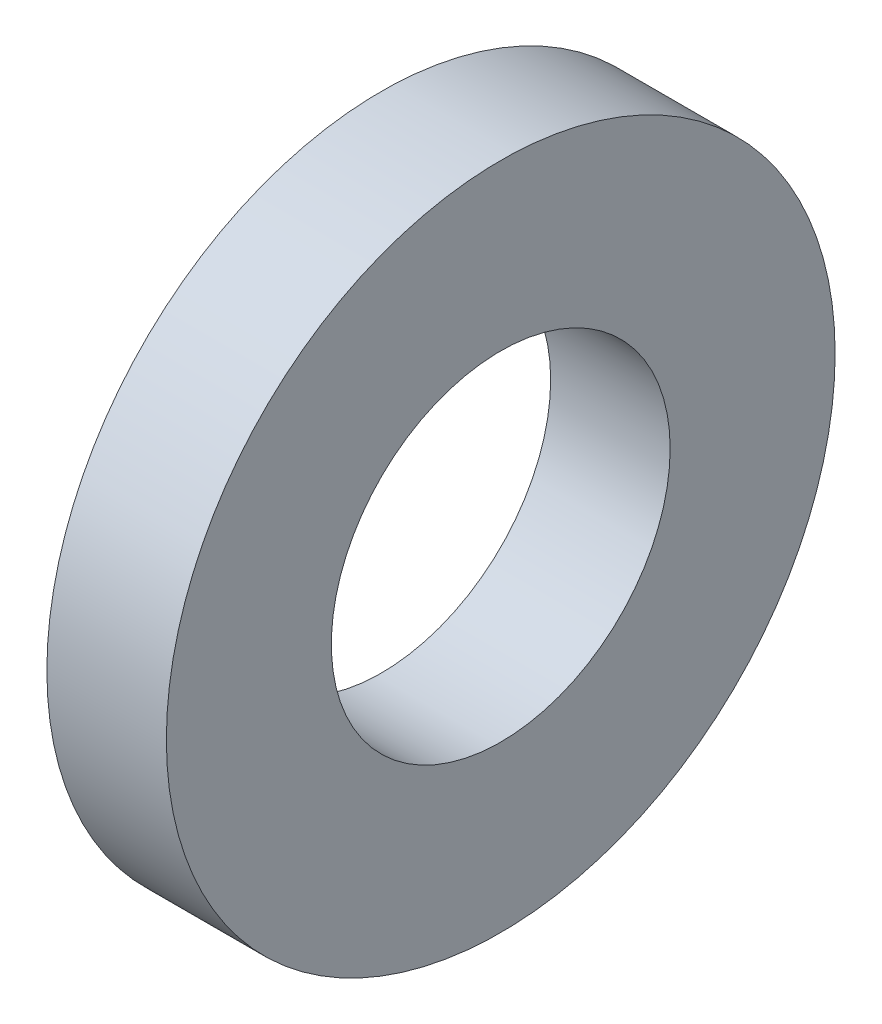
ISO-10303-21;
HEADER;
FILE_DESCRIPTION(('STEP AP214'),'2;1');
FILE_NAME('part.step','',(''),(''),'','','');
FILE_SCHEMA(('AUTOMOTIVE_DESIGN { 1 0 10303 214 1 1 1 1 }'));
ENDSEC;
DATA;
#1=APPLICATION_CONTEXT('core data for automotive mechanical design processes');
#2=APPLICATION_PROTOCOL_DEFINITION('international standard','automotive_design',2000,#1);
#3=PRODUCT_CONTEXT('',#1,'mechanical');
#4=PRODUCT('Part','Part','',(#3));
#5=PRODUCT_RELATED_PRODUCT_CATEGORY('part','',(#4));
#6=PRODUCT_DEFINITION_FORMATION('','',#4);
#7=PRODUCT_DEFINITION_CONTEXT('part definition',#1,'design');
#8=PRODUCT_DEFINITION('design','',#6,#7);
#9=PRODUCT_DEFINITION_SHAPE('','',#8);
#10=(LENGTH_UNIT() NAMED_UNIT(*) SI_UNIT(.MILLI.,.METRE.));
#11=(NAMED_UNIT(*) PLANE_ANGLE_UNIT() SI_UNIT($,.RADIAN.));
#12=(NAMED_UNIT(*) SI_UNIT($,.STERADIAN.) SOLID_ANGLE_UNIT());
#13=UNCERTAINTY_MEASURE_WITH_UNIT(LENGTH_MEASURE(1.E-05),#10,'distance_accuracy_value','');
#14=(GEOMETRIC_REPRESENTATION_CONTEXT(3) GLOBAL_UNCERTAINTY_ASSIGNED_CONTEXT((#13)) GLOBAL_UNIT_ASSIGNED_CONTEXT((#10,
#11,#12)) REPRESENTATION_CONTEXT('',''));
#15=CARTESIAN_POINT('',(0.,0.,0.));
#16=DIRECTION('',(0.,0.,1.));
#17=DIRECTION('',(1.,0.,0.));
#18=AXIS2_PLACEMENT_3D('',#15,#16,#17);
#19=CARTESIAN_POINT('',(1.7018,0.,0.));
#20=DIRECTION('',(1.,0.,0.));
#21=DIRECTION('',(0.,0.,-1.));
#22=AXIS2_PLACEMENT_3D('',#19,#20,#21);
#23=PLANE('',#22);
#24=CARTESIAN_POINT('',(1.7018,0.,0.));
#25=DIRECTION('',(1.,0.,0.));
#26=DIRECTION('',(0.,0.,-1.));
#27=AXIS2_PLACEMENT_3D('',#24,#25,#26);
#28=CIRCLE('',#27,4.7625);
#29=CARTESIAN_POINT('',(1.7018,0.,-4.7625));
#30=VERTEX_POINT('',#29);
#31=EDGE_CURVE('E10',#30,#30,#28,.T.);
#32=ORIENTED_EDGE('',*,*,#31,.T.);
#33=EDGE_LOOP('',(#32));
#34=FACE_BOUND('',#33,.T.);
#35=CARTESIAN_POINT('',(1.7018,0.,0.));
#36=DIRECTION('',(1.,0.,0.));
#37=DIRECTION('',(0.,0.,-1.));
#38=AXIS2_PLACEMENT_3D('',#35,#36,#37);
#39=CIRCLE('',#38,2.413);
#40=CARTESIAN_POINT('',(1.7018,0.,-2.413));
#41=VERTEX_POINT('',#40);
#42=EDGE_CURVE('E41',#41,#41,#39,.T.);
#43=ORIENTED_EDGE('',*,*,#42,.F.);
#44=EDGE_LOOP('',(#43));
#45=FACE_BOUND('',#44,.T.);
#46=ADVANCED_FACE('F30',(#34,#45),#23,.T.);
#47=CARTESIAN_POINT('',(0.,0.,0.));
#48=DIRECTION('',(1.,0.,0.));
#49=DIRECTION('',(0.,0.,-1.));
#50=AXIS2_PLACEMENT_3D('',#47,#48,#49);
#51=PLANE('',#50);
#52=CARTESIAN_POINT('',(0.,0.,0.));
#53=DIRECTION('',(1.,0.,0.));
#54=DIRECTION('',(0.,0.,-1.));
#55=AXIS2_PLACEMENT_3D('',#52,#53,#54);
#56=CIRCLE('',#55,4.7625);
#57=CARTESIAN_POINT('',(0.,0.,-4.7625));
#58=VERTEX_POINT('',#57);
#59=EDGE_CURVE('E34',#58,#58,#56,.T.);
#60=ORIENTED_EDGE('',*,*,#59,.F.);
#61=EDGE_LOOP('',(#60));
#62=FACE_BOUND('',#61,.T.);
#63=CARTESIAN_POINT('',(0.,0.,0.));
#64=DIRECTION('',(1.,0.,0.));
#65=DIRECTION('',(0.,0.,-1.));
#66=AXIS2_PLACEMENT_3D('',#63,#64,#65);
#67=CIRCLE('',#66,2.413);
#68=CARTESIAN_POINT('',(0.,0.,-2.413));
#69=VERTEX_POINT('',#68);
#70=EDGE_CURVE('E43',#69,#69,#67,.T.);
#71=ORIENTED_EDGE('',*,*,#70,.T.);
#72=EDGE_LOOP('',(#71));
#73=FACE_BOUND('',#72,.T.);
#74=ADVANCED_FACE('F53',(#62,#73),#51,.F.);
#75=CARTESIAN_POINT('',(1.7018,0.,0.));
#76=DIRECTION('',(-1.,0.,0.));
#77=DIRECTION('',(0.,0.,1.));
#78=AXIS2_PLACEMENT_3D('',#75,#76,#77);
#79=CYLINDRICAL_SURFACE('',#78,4.7625);
#80=ORIENTED_EDGE('',*,*,#31,.F.);
#81=EDGE_LOOP('',(#80));
#82=FACE_BOUND('',#81,.T.);
#83=ORIENTED_EDGE('',*,*,#59,.T.);
#84=EDGE_LOOP('',(#83));
#85=FACE_BOUND('',#84,.T.);
#86=ADVANCED_FACE('F32',(#82,#85),#79,.T.);
#87=CARTESIAN_POINT('',(1.7018,0.,0.));
#88=DIRECTION('',(-1.,0.,0.));
#89=DIRECTION('',(0.,0.,1.));
#90=AXIS2_PLACEMENT_3D('',#87,#88,#89);
#91=CYLINDRICAL_SURFACE('',#90,2.413);
#92=ORIENTED_EDGE('',*,*,#42,.T.);
#93=EDGE_LOOP('',(#92));
#94=FACE_BOUND('',#93,.T.);
#95=ORIENTED_EDGE('',*,*,#70,.F.);
#96=EDGE_LOOP('',(#95));
#97=FACE_BOUND('',#96,.T.);
#98=ADVANCED_FACE('F49',(#94,#97),#91,.F.);
#99=CLOSED_SHELL('',(#46,#74,#86,#98));
#100=MANIFOLD_SOLID_BREP('B2',#99);
#101=ADVANCED_BREP_SHAPE_REPRESENTATION('',(#18,#100),#14);
#102=SHAPE_DEFINITION_REPRESENTATION(#9,#101);
ENDSEC;
END-ISO-10303-21;
